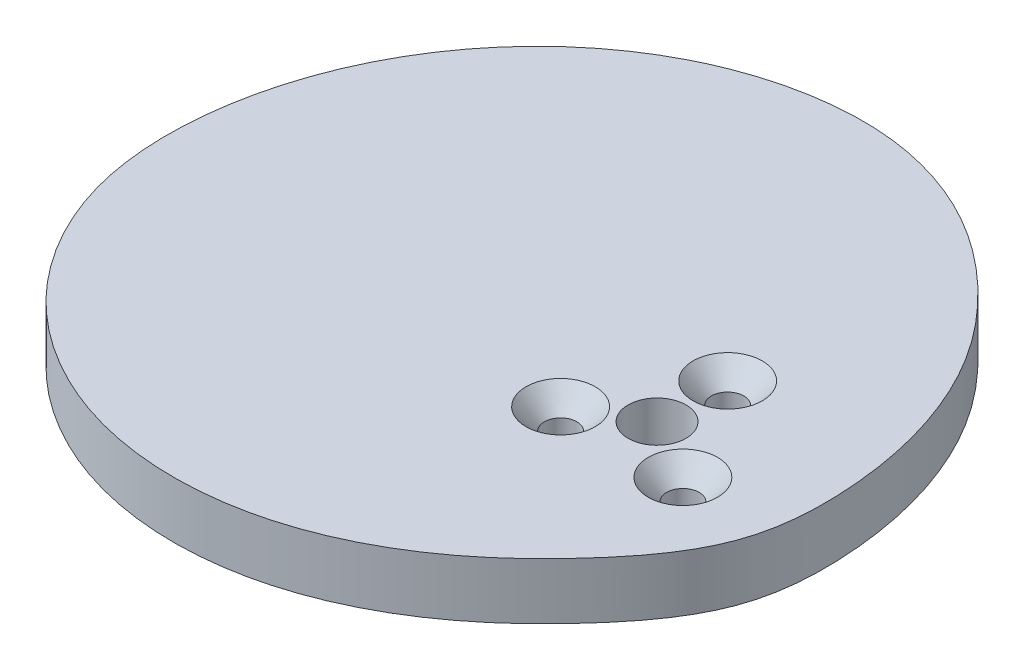
ISO-10303-21;
HEADER;
FILE_DESCRIPTION(('STEP AP214'),'2;1');
FILE_NAME('part.step','',(''),(''),'','','');
FILE_SCHEMA(('AUTOMOTIVE_DESIGN { 1 0 10303 214 1 1 1 1 }'));
ENDSEC;
DATA;
#1=APPLICATION_CONTEXT('core data for automotive mechanical design processes');
#2=APPLICATION_PROTOCOL_DEFINITION('international standard','automotive_design',2000,#1);
#3=PRODUCT_CONTEXT('',#1,'mechanical');
#4=PRODUCT('Part','Part','',(#3));
#5=PRODUCT_RELATED_PRODUCT_CATEGORY('part','',(#4));
#6=PRODUCT_DEFINITION_FORMATION('','',#4);
#7=PRODUCT_DEFINITION_CONTEXT('part definition',#1,'design');
#8=PRODUCT_DEFINITION('design','',#6,#7);
#9=PRODUCT_DEFINITION_SHAPE('','',#8);
#10=(LENGTH_UNIT() NAMED_UNIT(*) SI_UNIT(.MILLI.,.METRE.));
#11=(NAMED_UNIT(*) PLANE_ANGLE_UNIT() SI_UNIT($,.RADIAN.));
#12=(NAMED_UNIT(*) SI_UNIT($,.STERADIAN.) SOLID_ANGLE_UNIT());
#13=UNCERTAINTY_MEASURE_WITH_UNIT(LENGTH_MEASURE(1.E-05),#10,'distance_accuracy_value','');
#14=(GEOMETRIC_REPRESENTATION_CONTEXT(3) GLOBAL_UNCERTAINTY_ASSIGNED_CONTEXT((#13)) GLOBAL_UNIT_ASSIGNED_CONTEXT((#10,
#11,#12)) REPRESENTATION_CONTEXT('',''));
#15=CARTESIAN_POINT('',(0.,0.,0.));
#16=DIRECTION('',(0.,0.,1.));
#17=DIRECTION('',(1.,0.,0.));
#18=AXIS2_PLACEMENT_3D('',#15,#16,#17);
#19=CARTESIAN_POINT('',(-5.3917472176731,6.35,28.7715796919059));
#20=DIRECTION('',(0.,-1.,0.));
#21=DIRECTION('',(0.,0.,-1.));
#22=AXIS2_PLACEMENT_3D('',#19,#20,#21);
#23=PLANE('',#22);
#24=CARTESIAN_POINT('',(6.88507516516704,6.35,3.9751));
#25=DIRECTION('',(0.,1.,0.));
#26=DIRECTION('',(0.,0.,1.));
#27=AXIS2_PLACEMENT_3D('',#24,#25,#26);
#28=CIRCLE('',#27,3.8989);
#29=CARTESIAN_POINT('',(6.88507516516704,6.35,7.874));
#30=VERTEX_POINT('',#29);
#31=EDGE_CURVE('E78',#30,#30,#28,.T.);
#32=ORIENTED_EDGE('',*,*,#31,.F.);
#33=EDGE_LOOP('',(#32));
#34=FACE_BOUND('',#33,.T.);
#35=CARTESIAN_POINT('',(-6.88507516516704,6.35,3.9751));
#36=DIRECTION('',(0.,1.,0.));
#37=DIRECTION('',(0.,0.,1.));
#38=AXIS2_PLACEMENT_3D('',#35,#36,#37);
#39=CIRCLE('',#38,3.8989);
#40=CARTESIAN_POINT('',(-6.88507516516704,6.35,7.874));
#41=VERTEX_POINT('',#40);
#42=EDGE_CURVE('E69',#41,#41,#39,.T.);
#43=ORIENTED_EDGE('',*,*,#42,.F.);
#44=EDGE_LOOP('',(#43));
#45=FACE_BOUND('',#44,.T.);
#46=CARTESIAN_POINT('',(0.,6.35,0.));
#47=DIRECTION('',(0.,1.,0.));
#48=DIRECTION('',(0.,0.,1.));
#49=AXIS2_PLACEMENT_3D('',#46,#47,#48);
#50=CIRCLE('',#49,3.2639);
#51=CARTESIAN_POINT('',(0.,6.35,3.2639));
#52=VERTEX_POINT('',#51);
#53=EDGE_CURVE('E60',#52,#52,#50,.T.);
#54=ORIENTED_EDGE('',*,*,#53,.F.);
#55=EDGE_LOOP('',(#54));
#56=FACE_BOUND('',#55,.T.);
#57=CARTESIAN_POINT('',(-33.4541490089645,6.35,-37.0570814245358));
#58=CARTESIAN_POINT('',(-35.7767836664498,6.35,-35.885015819578));
#59=CARTESIAN_POINT('',(-41.2325678196069,6.35,-32.3646687966277));
#60=CARTESIAN_POINT('',(-47.6162355285775,6.35,-25.5331893218332));
#61=CARTESIAN_POINT('',(-52.6862891290967,6.35,-16.4708874995564));
#62=CARTESIAN_POINT('',(-55.9328033755798,6.35,-5.28387979648484));
#63=CARTESIAN_POINT('',(-55.6410657807999,6.35,7.15069652588735));
#64=CARTESIAN_POINT('',(-50.8525945927224,6.35,17.4799573467359));
#65=CARTESIAN_POINT('',(-43.8939290752329,6.35,25.5443059233995));
#66=CARTESIAN_POINT('',(-34.7754445018004,6.35,30.8149957181968));
#67=CARTESIAN_POINT('',(-23.5159347987013,6.35,33.1288498695909));
#68=CARTESIAN_POINT('',(-11.9567934362027,6.35,32.0701901032004));
#69=CARTESIAN_POINT('',(0.0251940850055831,6.35,26.4260766485361));
#70=CARTESIAN_POINT('',(9.56509101595053,6.35,17.6222734276514));
#71=CARTESIAN_POINT('',(17.2364426143222,6.35,7.36118165150985));
#72=CARTESIAN_POINT('',(17.7154749325682,6.35,-4.54839326660657));
#73=CARTESIAN_POINT('',(15.6857093706724,6.35,-14.9934826442274));
#74=CARTESIAN_POINT('',(11.4954954476822,6.35,-23.8613138771916));
#75=CARTESIAN_POINT('',(4.95484544877421,6.35,-31.74124115277));
#76=CARTESIAN_POINT('',(-3.41947237232282,6.35,-38.0396268965792));
#77=CARTESIAN_POINT('',(-13.1646871944696,6.35,-41.029089181406));
#78=CARTESIAN_POINT('',(-23.2614666274389,6.35,-40.9457952020731));
#79=CARTESIAN_POINT('',(-29.7791434687213,6.35,-38.9115907326902));
#80=CARTESIAN_POINT('',(-33.4541490089645,6.35,-37.0570814245358));
#81=B_SPLINE_CURVE_WITH_KNOTS('',3,(#57,#58,#59,#60,#61,#62,#63,#64,#65,#66,#67,#68,#69,#70,#71,
#72,#73,#74,#75,#76,#77,#78,#79,#80),.UNSPECIFIED.,.T.,.F.,(4,1,1,1,1,1,1,1,1,1,1,1,1,1,1,1,1,1,
1,1,1,4),(0.,0.0340947554049977,0.0849169228331515,0.121026098263529,0.169787863439254,
0.236773028663806,0.279059208917504,0.316999297575864,0.375439157281275,0.413458711460413,
0.466845740047166,0.525018888762857,0.583821808716174,0.637339399744292,0.687495989815128,
0.734591887553009,0.776971984746427,0.814693535232852,0.868458998423307,0.91222373086956,
0.946053325863025,1.),.UNSPECIFIED.);
#82=CARTESIAN_POINT('',(-33.4541490089645,6.35,-37.0570814245358));
#83=VERTEX_POINT('',#82);
#84=EDGE_CURVE('E10',#83,#83,#81,.T.);
#85=ORIENTED_EDGE('',*,*,#84,.T.);
#86=EDGE_LOOP('',(#85));
#87=FACE_BOUND('',#86,.T.);
#88=CARTESIAN_POINT('',(0.,6.35,-7.9502));
#89=DIRECTION('',(0.,1.,0.));
#90=DIRECTION('',(0.,0.,1.));
#91=AXIS2_PLACEMENT_3D('',#88,#89,#90);
#92=CIRCLE('',#91,3.8989);
#93=CARTESIAN_POINT('',(0.,6.35,-4.0513));
#94=VERTEX_POINT('',#93);
#95=EDGE_CURVE('E87',#94,#94,#92,.T.);
#96=ORIENTED_EDGE('',*,*,#95,.F.);
#97=EDGE_LOOP('',(#96));
#98=FACE_BOUND('',#97,.T.);
#99=ADVANCED_FACE('F37',(#34,#45,#56,#87,#98),#23,.F.);
#100=CARTESIAN_POINT('',(-5.3917472176731,0.,28.7715796919059));
#101=DIRECTION('',(0.,-1.,0.));
#102=DIRECTION('',(0.,0.,-1.));
#103=AXIS2_PLACEMENT_3D('',#100,#101,#102);
#104=PLANE('',#103);
#105=CARTESIAN_POINT('',(0.,0.,-7.9502));
#106=DIRECTION('',(0.,1.,0.));
#107=DIRECTION('',(0.,0.,1.));
#108=AXIS2_PLACEMENT_3D('',#105,#106,#107);
#109=CIRCLE('',#108,1.82879999999999);
#110=CARTESIAN_POINT('',(0.,0.,-6.12140000000001));
#111=VERTEX_POINT('',#110);
#112=EDGE_CURVE('E81',#111,#111,#109,.T.);
#113=ORIENTED_EDGE('',*,*,#112,.T.);
#114=EDGE_LOOP('',(#113));
#115=FACE_BOUND('',#114,.T.);
#116=CARTESIAN_POINT('',(6.88507516516704,0.,3.9751));
#117=DIRECTION('',(0.,1.,0.));
#118=DIRECTION('',(0.,0.,1.));
#119=AXIS2_PLACEMENT_3D('',#116,#117,#118);
#120=CIRCLE('',#119,1.82879999999999);
#121=CARTESIAN_POINT('',(6.88507516516704,0.,5.80389999999999));
#122=VERTEX_POINT('',#121);
#123=EDGE_CURVE('E72',#122,#122,#120,.T.);
#124=ORIENTED_EDGE('',*,*,#123,.T.);
#125=EDGE_LOOP('',(#124));
#126=FACE_BOUND('',#125,.T.);
#127=CARTESIAN_POINT('',(-6.88507516516704,0.,3.9751));
#128=DIRECTION('',(0.,1.,0.));
#129=DIRECTION('',(0.,0.,1.));
#130=AXIS2_PLACEMENT_3D('',#127,#128,#129);
#131=CIRCLE('',#130,1.82879999999999);
#132=CARTESIAN_POINT('',(-6.88507516516704,0.,5.80389999999998));
#133=VERTEX_POINT('',#132);
#134=EDGE_CURVE('E63',#133,#133,#131,.T.);
#135=ORIENTED_EDGE('',*,*,#134,.T.);
#136=EDGE_LOOP('',(#135));
#137=FACE_BOUND('',#136,.T.);
#138=CARTESIAN_POINT('',(-33.4541490089645,0.,-37.0570814245358));
#139=CARTESIAN_POINT('',(-35.7767836664498,0.,-35.885015819578));
#140=CARTESIAN_POINT('',(-41.2325678196069,0.,-32.3646687966277));
#141=CARTESIAN_POINT('',(-47.6162355285775,0.,-25.5331893218332));
#142=CARTESIAN_POINT('',(-52.6862891290967,0.,-16.4708874995564));
#143=CARTESIAN_POINT('',(-55.9328033755798,0.,-5.28387979648484));
#144=CARTESIAN_POINT('',(-55.6410657807999,0.,7.15069652588735));
#145=CARTESIAN_POINT('',(-50.8525945927224,0.,17.4799573467359));
#146=CARTESIAN_POINT('',(-43.8939290752329,0.,25.5443059233995));
#147=CARTESIAN_POINT('',(-34.7754445018004,0.,30.8149957181968));
#148=CARTESIAN_POINT('',(-23.5159347987013,0.,33.1288498695909));
#149=CARTESIAN_POINT('',(-11.9567934362027,0.,32.0701901032004));
#150=CARTESIAN_POINT('',(0.0251940850055831,0.,26.4260766485361));
#151=CARTESIAN_POINT('',(9.56509101595053,0.,17.6222734276514));
#152=CARTESIAN_POINT('',(17.2364426143222,0.,7.36118165150985));
#153=CARTESIAN_POINT('',(17.7154749325682,0.,-4.54839326660657));
#154=CARTESIAN_POINT('',(15.6857093706724,0.,-14.9934826442274));
#155=CARTESIAN_POINT('',(11.4954954476822,0.,-23.8613138771916));
#156=CARTESIAN_POINT('',(4.95484544877421,0.,-31.74124115277));
#157=CARTESIAN_POINT('',(-3.41947237232282,0.,-38.0396268965792));
#158=CARTESIAN_POINT('',(-13.1646871944696,0.,-41.029089181406));
#159=CARTESIAN_POINT('',(-23.2614666274389,0.,-40.9457952020731));
#160=CARTESIAN_POINT('',(-29.7791434687213,0.,-38.9115907326902));
#161=CARTESIAN_POINT('',(-33.4541490089645,0.,-37.0570814245358));
#162=B_SPLINE_CURVE_WITH_KNOTS('',3,(#138,#139,#140,#141,#142,#143,#144,#145,#146,#147,#148,
#149,#150,#151,#152,#153,#154,#155,#156,#157,#158,#159,#160,#161),.UNSPECIFIED.,.T.,.F.,(4,1,1,
1,1,1,1,1,1,1,1,1,1,1,1,1,1,1,1,1,1,4),(0.,0.0340947554049977,0.0849169228331515,
0.121026098263529,0.169787863439254,0.236773028663806,0.279059208917504,0.316999297575864,
0.375439157281275,0.413458711460413,0.466845740047166,0.525018888762857,0.583821808716174,
0.637339399744292,0.687495989815128,0.734591887553009,0.776971984746427,0.814693535232852,
0.868458998423307,0.91222373086956,0.946053325863025,1.),.UNSPECIFIED.);
#163=CARTESIAN_POINT('',(-33.4541490089645,0.,-37.0570814245358));
#164=VERTEX_POINT('',#163);
#165=EDGE_CURVE('E42',#164,#164,#162,.T.);
#166=ORIENTED_EDGE('',*,*,#165,.F.);
#167=EDGE_LOOP('',(#166));
#168=FACE_BOUND('',#167,.T.);
#169=CARTESIAN_POINT('',(0.,0.,0.));
#170=DIRECTION('',(0.,1.,0.));
#171=DIRECTION('',(0.,0.,1.));
#172=AXIS2_PLACEMENT_3D('',#169,#170,#171);
#173=CIRCLE('',#172,3.2639);
#174=CARTESIAN_POINT('',(0.,0.,3.2639));
#175=VERTEX_POINT('',#174);
#176=EDGE_CURVE('E50',#175,#175,#173,.T.);
#177=ORIENTED_EDGE('',*,*,#176,.T.);
#178=EDGE_LOOP('',(#177));
#179=FACE_BOUND('',#178,.T.);
#180=ADVANCED_FACE('F94',(#115,#126,#137,#168,#179),#104,.T.);
#181=DIRECTION('',(0.,-1.,0.));
#182=VECTOR('',#181,1.);
#183=SURFACE_OF_LINEAR_EXTRUSION('',#81,#182);
#184=ORIENTED_EDGE('',*,*,#84,.F.);
#185=EDGE_LOOP('',(#184));
#186=FACE_BOUND('',#185,.T.);
#187=ORIENTED_EDGE('',*,*,#165,.T.);
#188=EDGE_LOOP('',(#187));
#189=FACE_BOUND('',#188,.T.);
#190=ADVANCED_FACE('F39',(#186,#189),#183,.F.);
#191=CARTESIAN_POINT('',(0.,6.35,0.));
#192=DIRECTION('',(0.,1.,0.));
#193=DIRECTION('',(0.,0.,1.));
#194=AXIS2_PLACEMENT_3D('',#191,#192,#193);
#195=CYLINDRICAL_SURFACE('',#194,3.2639);
#196=ORIENTED_EDGE('',*,*,#176,.F.);
#197=EDGE_LOOP('',(#196));
#198=FACE_BOUND('',#197,.T.);
#199=ORIENTED_EDGE('',*,*,#53,.T.);
#200=EDGE_LOOP('',(#199));
#201=FACE_BOUND('',#200,.T.);
#202=ADVANCED_FACE('F105',(#198,#201),#195,.F.);
#203=CARTESIAN_POINT('',(-6.88507516516704,6.35,3.9751));
#204=DIRECTION('',(0.,1.,0.));
#205=DIRECTION('',(0.,0.,1.));
#206=AXIS2_PLACEMENT_3D('',#203,#204,#205);
#207=CYLINDRICAL_SURFACE('',#206,1.82879999999999);
#208=ORIENTED_EDGE('',*,*,#134,.F.);
#209=EDGE_LOOP('',(#208));
#210=FACE_BOUND('',#209,.T.);
#211=CARTESIAN_POINT('',(-6.88507516516704,3.96862236021179,3.9751));
#212=DIRECTION('',(0.,1.,0.));
#213=DIRECTION('',(0.,0.,1.));
#214=AXIS2_PLACEMENT_3D('',#211,#212,#213);
#215=CIRCLE('',#214,1.8288);
#216=CARTESIAN_POINT('',(-6.88507516516704,3.96862236021179,5.8039));
#217=VERTEX_POINT('',#216);
#218=EDGE_CURVE('E66',#217,#217,#215,.T.);
#219=ORIENTED_EDGE('',*,*,#218,.T.);
#220=EDGE_LOOP('',(#219));
#221=FACE_BOUND('',#220,.T.);
#222=ADVANCED_FACE('F107',(#210,#221),#207,.F.);
#223=CARTESIAN_POINT('',(-6.88507516516704,6.35,3.9751));
#224=DIRECTION('',(0.,1.,0.));
#225=DIRECTION('',(0.,0.,1.));
#226=AXIS2_PLACEMENT_3D('',#223,#224,#225);
#227=CONICAL_SURFACE('',#226,3.8989,0.715584993317675);
#228=ORIENTED_EDGE('',*,*,#218,.F.);
#229=EDGE_LOOP('',(#228));
#230=FACE_BOUND('',#229,.T.);
#231=ORIENTED_EDGE('',*,*,#42,.T.);
#232=EDGE_LOOP('',(#231));
#233=FACE_BOUND('',#232,.T.);
#234=ADVANCED_FACE('F111',(#230,#233),#227,.F.);
#235=CARTESIAN_POINT('',(6.88507516516704,6.35,3.9751));
#236=DIRECTION('',(0.,1.,0.));
#237=DIRECTION('',(0.,0.,1.));
#238=AXIS2_PLACEMENT_3D('',#235,#236,#237);
#239=CYLINDRICAL_SURFACE('',#238,1.82879999999999);
#240=ORIENTED_EDGE('',*,*,#123,.F.);
#241=EDGE_LOOP('',(#240));
#242=FACE_BOUND('',#241,.T.);
#243=CARTESIAN_POINT('',(6.88507516516704,3.96862236021179,3.9751));
#244=DIRECTION('',(0.,1.,0.));
#245=DIRECTION('',(0.,0.,1.));
#246=AXIS2_PLACEMENT_3D('',#243,#244,#245);
#247=CIRCLE('',#246,1.8288);
#248=CARTESIAN_POINT('',(6.88507516516704,3.96862236021179,5.8039));
#249=VERTEX_POINT('',#248);
#250=EDGE_CURVE('E75',#249,#249,#247,.T.);
#251=ORIENTED_EDGE('',*,*,#250,.T.);
#252=EDGE_LOOP('',(#251));
#253=FACE_BOUND('',#252,.T.);
#254=ADVANCED_FACE('F115',(#242,#253),#239,.F.);
#255=CARTESIAN_POINT('',(6.88507516516704,6.35,3.9751));
#256=DIRECTION('',(0.,1.,0.));
#257=DIRECTION('',(0.,0.,1.));
#258=AXIS2_PLACEMENT_3D('',#255,#256,#257);
#259=CONICAL_SURFACE('',#258,3.8989,0.715584993317675);
#260=ORIENTED_EDGE('',*,*,#250,.F.);
#261=EDGE_LOOP('',(#260));
#262=FACE_BOUND('',#261,.T.);
#263=ORIENTED_EDGE('',*,*,#31,.T.);
#264=EDGE_LOOP('',(#263));
#265=FACE_BOUND('',#264,.T.);
#266=ADVANCED_FACE('F119',(#262,#265),#259,.F.);
#267=CARTESIAN_POINT('',(0.,6.35,-7.9502));
#268=DIRECTION('',(0.,1.,0.));
#269=DIRECTION('',(0.,0.,1.));
#270=AXIS2_PLACEMENT_3D('',#267,#268,#269);
#271=CYLINDRICAL_SURFACE('',#270,1.82879999999999);
#272=ORIENTED_EDGE('',*,*,#112,.F.);
#273=EDGE_LOOP('',(#272));
#274=FACE_BOUND('',#273,.T.);
#275=CARTESIAN_POINT('',(0.,3.96862236021179,-7.9502));
#276=DIRECTION('',(0.,1.,0.));
#277=DIRECTION('',(0.,0.,1.));
#278=AXIS2_PLACEMENT_3D('',#275,#276,#277);
#279=CIRCLE('',#278,1.8288);
#280=CARTESIAN_POINT('',(0.,3.96862236021179,-6.1214));
#281=VERTEX_POINT('',#280);
#282=EDGE_CURVE('E84',#281,#281,#279,.T.);
#283=ORIENTED_EDGE('',*,*,#282,.T.);
#284=EDGE_LOOP('',(#283));
#285=FACE_BOUND('',#284,.T.);
#286=ADVANCED_FACE('F123',(#274,#285),#271,.F.);
#287=CARTESIAN_POINT('',(0.,6.35,-7.9502));
#288=DIRECTION('',(0.,1.,0.));
#289=DIRECTION('',(0.,0.,1.));
#290=AXIS2_PLACEMENT_3D('',#287,#288,#289);
#291=CONICAL_SURFACE('',#290,3.8989,0.715584993317675);
#292=ORIENTED_EDGE('',*,*,#282,.F.);
#293=EDGE_LOOP('',(#292));
#294=FACE_BOUND('',#293,.T.);
#295=ORIENTED_EDGE('',*,*,#95,.T.);
#296=EDGE_LOOP('',(#295));
#297=FACE_BOUND('',#296,.T.);
#298=ADVANCED_FACE('F91',(#294,#297),#291,.F.);
#299=CLOSED_SHELL('',(#99,#180,#190,#202,#222,#234,#254,#266,#286,#298));
#300=MANIFOLD_SOLID_BREP('B2',#299);
#301=ADVANCED_BREP_SHAPE_REPRESENTATION('',(#18,#300),#14);
#302=SHAPE_DEFINITION_REPRESENTATION(#9,#301);
ENDSEC;
END-ISO-10303-21;
